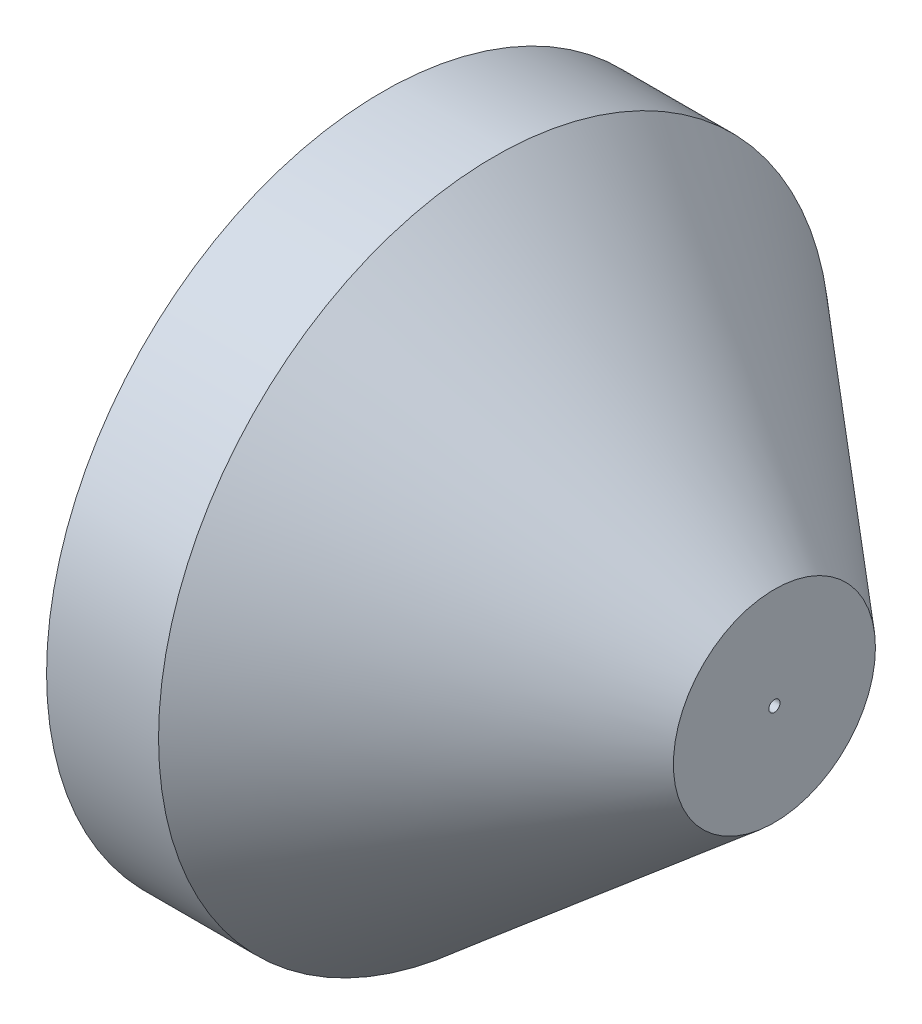
ISO-10303-21;
HEADER;
FILE_DESCRIPTION(('STEP AP214'),'2;1');
FILE_NAME('part.step','',(''),(''),'','','');
FILE_SCHEMA(('AUTOMOTIVE_DESIGN { 1 0 10303 214 1 1 1 1 }'));
ENDSEC;
DATA;
#1=APPLICATION_CONTEXT('core data for automotive mechanical design processes');
#2=APPLICATION_PROTOCOL_DEFINITION('international standard','automotive_design',2000,#1);
#3=PRODUCT_CONTEXT('',#1,'mechanical');
#4=PRODUCT('Part','Part','',(#3));
#5=PRODUCT_RELATED_PRODUCT_CATEGORY('part','',(#4));
#6=PRODUCT_DEFINITION_FORMATION('','',#4);
#7=PRODUCT_DEFINITION_CONTEXT('part definition',#1,'design');
#8=PRODUCT_DEFINITION('design','',#6,#7);
#9=PRODUCT_DEFINITION_SHAPE('','',#8);
#10=(LENGTH_UNIT() NAMED_UNIT(*) SI_UNIT(.MILLI.,.METRE.));
#11=(NAMED_UNIT(*) PLANE_ANGLE_UNIT() SI_UNIT($,.RADIAN.));
#12=(NAMED_UNIT(*) SI_UNIT($,.STERADIAN.) SOLID_ANGLE_UNIT());
#13=UNCERTAINTY_MEASURE_WITH_UNIT(LENGTH_MEASURE(1.E-05),#10,'distance_accuracy_value','');
#14=(GEOMETRIC_REPRESENTATION_CONTEXT(3) GLOBAL_UNCERTAINTY_ASSIGNED_CONTEXT((#13)) GLOBAL_UNIT_ASSIGNED_CONTEXT((#10,
#11,#12)) REPRESENTATION_CONTEXT('',''));
#15=CARTESIAN_POINT('',(0.,0.,0.));
#16=DIRECTION('',(0.,0.,1.));
#17=DIRECTION('',(1.,0.,0.));
#18=AXIS2_PLACEMENT_3D('',#15,#16,#17);
#19=CARTESIAN_POINT('',(0.,0.,0.));
#20=DIRECTION('',(1.,0.,0.));
#21=DIRECTION('',(0.,0.,-1.));
#22=AXIS2_PLACEMENT_3D('',#19,#20,#21);
#23=PLANE('',#22);
#24=CARTESIAN_POINT('',(0.,0.,0.));
#25=DIRECTION('',(1.,0.,0.));
#26=DIRECTION('',(0.,0.,-1.));
#27=AXIS2_PLACEMENT_3D('',#24,#25,#26);
#28=CIRCLE('',#27,50.);
#29=CARTESIAN_POINT('',(0.,0.,-50.));
#30=VERTEX_POINT('',#29);
#31=EDGE_CURVE('E34',#30,#30,#28,.T.);
#32=ORIENTED_EDGE('',*,*,#31,.F.);
#33=EDGE_LOOP('',(#32));
#34=FACE_BOUND('',#33,.T.);
#35=CARTESIAN_POINT('',(0.,0.,0.));
#36=DIRECTION('',(1.,0.,0.));
#37=DIRECTION('',(0.,0.,-1.));
#38=AXIS2_PLACEMENT_3D('',#35,#36,#37);
#39=CIRCLE('',#38,30.);
#40=CARTESIAN_POINT('',(0.,0.,-30.));
#41=VERTEX_POINT('',#40);
#42=EDGE_CURVE('E41',#41,#41,#39,.T.);
#43=ORIENTED_EDGE('',*,*,#42,.T.);
#44=EDGE_LOOP('',(#43));
#45=FACE_BOUND('',#44,.T.);
#46=ADVANCED_FACE('F30',(#34,#45),#23,.F.);
#47=CARTESIAN_POINT('',(20.,0.,0.));
#48=DIRECTION('',(-1.,0.,0.));
#49=DIRECTION('',(0.,0.,1.));
#50=AXIS2_PLACEMENT_3D('',#47,#48,#49);
#51=CYLINDRICAL_SURFACE('',#50,50.);
#52=CARTESIAN_POINT('',(20.,0.,0.));
#53=DIRECTION('',(1.,0.,0.));
#54=DIRECTION('',(0.,0.,-1.));
#55=AXIS2_PLACEMENT_3D('',#52,#53,#54);
#56=CIRCLE('',#55,50.);
#57=CARTESIAN_POINT('',(20.,0.,-50.));
#58=VERTEX_POINT('',#57);
#59=EDGE_CURVE('E10',#58,#58,#56,.T.);
#60=ORIENTED_EDGE('',*,*,#59,.F.);
#61=EDGE_LOOP('',(#60));
#62=FACE_BOUND('',#61,.T.);
#63=ORIENTED_EDGE('',*,*,#31,.T.);
#64=EDGE_LOOP('',(#63));
#65=FACE_BOUND('',#64,.T.);
#66=ADVANCED_FACE('F32',(#62,#65),#51,.T.);
#67=CARTESIAN_POINT('',(20.,0.,0.));
#68=DIRECTION('',(-1.,0.,0.));
#69=DIRECTION('',(0.,0.,1.));
#70=AXIS2_PLACEMENT_3D('',#67,#68,#69);
#71=CYLINDRICAL_SURFACE('',#70,30.);
#72=CARTESIAN_POINT('',(20.,0.,0.));
#73=DIRECTION('',(1.,0.,0.));
#74=DIRECTION('',(0.,0.,-1.));
#75=AXIS2_PLACEMENT_3D('',#72,#73,#74);
#76=CIRCLE('',#75,30.);
#77=CARTESIAN_POINT('',(20.,0.,-30.));
#78=VERTEX_POINT('',#77);
#79=EDGE_CURVE('E45',#78,#78,#76,.T.);
#80=ORIENTED_EDGE('',*,*,#79,.T.);
#81=EDGE_LOOP('',(#80));
#82=FACE_BOUND('',#81,.T.);
#83=ORIENTED_EDGE('',*,*,#42,.F.);
#84=EDGE_LOOP('',(#83));
#85=FACE_BOUND('',#84,.T.);
#86=ADVANCED_FACE('F84',(#82,#85),#71,.F.);
#87=CARTESIAN_POINT('',(20.,0.,0.));
#88=DIRECTION('',(1.,0.,0.));
#89=DIRECTION('',(0.,0.,-1.));
#90=AXIS2_PLACEMENT_3D('',#87,#88,#89);
#91=PLANE('',#90);
#92=CARTESIAN_POINT('',(20.,0.,0.));
#93=DIRECTION('',(-1.,0.,0.));
#94=DIRECTION('',(0.,0.,1.));
#95=AXIS2_PLACEMENT_3D('',#92,#93,#94);
#96=CIRCLE('',#95,1.);
#97=CARTESIAN_POINT('',(20.,0.,1.));
#98=VERTEX_POINT('',#97);
#99=EDGE_CURVE('E64',#98,#98,#96,.T.);
#100=ORIENTED_EDGE('',*,*,#99,.F.);
#101=EDGE_LOOP('',(#100));
#102=FACE_BOUND('',#101,.T.);
#103=ORIENTED_EDGE('',*,*,#79,.F.);
#104=EDGE_LOOP('',(#103));
#105=FACE_BOUND('',#104,.T.);
#106=ADVANCED_FACE('F80',(#102,#105),#91,.F.);
#107=CARTESIAN_POINT('',(20.,0.,0.));
#108=DIRECTION('',(-1.,0.,0.));
#109=DIRECTION('',(0.,0.,1.));
#110=AXIS2_PLACEMENT_3D('',#107,#108,#109);
#111=CIRCLE('',#110,55.);
#112=CARTESIAN_POINT('',(20.,0.,55.));
#113=VERTEX_POINT('',#112);
#114=EDGE_CURVE('E58',#113,#113,#111,.T.);
#115=ORIENTED_EDGE('',*,*,#114,.T.);
#116=EDGE_LOOP('',(#115));
#117=FACE_BOUND('',#116,.T.);
#118=ORIENTED_EDGE('',*,*,#59,.T.);
#119=EDGE_LOOP('',(#118));
#120=FACE_BOUND('',#119,.T.);
#121=ADVANCED_FACE('F83',(#117,#120),#91,.F.);
#122=CARTESIAN_POINT('',(0.,0.,0.));
#123=DIRECTION('',(-1.,0.,0.));
#124=DIRECTION('',(0.,0.,1.));
#125=AXIS2_PLACEMENT_3D('',#122,#123,#124);
#126=PLANE('',#125);
#127=CARTESIAN_POINT('',(0.,0.,0.));
#128=DIRECTION('',(-1.,0.,0.));
#129=DIRECTION('',(0.,0.,1.));
#130=AXIS2_PLACEMENT_3D('',#127,#128,#129);
#131=CIRCLE('',#130,60.);
#132=CARTESIAN_POINT('',(0.,0.,60.));
#133=VERTEX_POINT('',#132);
#134=EDGE_CURVE('E51',#133,#133,#131,.T.);
#135=ORIENTED_EDGE('',*,*,#134,.T.);
#136=EDGE_LOOP('',(#135));
#137=FACE_BOUND('',#136,.T.);
#138=CARTESIAN_POINT('',(0.,0.,0.));
#139=DIRECTION('',(-1.,0.,0.));
#140=DIRECTION('',(0.,0.,1.));
#141=AXIS2_PLACEMENT_3D('',#138,#139,#140);
#142=CIRCLE('',#141,55.);
#143=CARTESIAN_POINT('',(0.,0.,55.));
#144=VERTEX_POINT('',#143);
#145=EDGE_CURVE('E55',#144,#144,#142,.T.);
#146=ORIENTED_EDGE('',*,*,#145,.F.);
#147=EDGE_LOOP('',(#146));
#148=FACE_BOUND('',#147,.T.);
#149=ADVANCED_FACE('F110',(#137,#148),#126,.T.);
#150=CARTESIAN_POINT('',(0.,0.,0.));
#151=DIRECTION('',(1.,0.,0.));
#152=DIRECTION('',(0.,0.,-1.));
#153=AXIS2_PLACEMENT_3D('',#150,#151,#152);
#154=CYLINDRICAL_SURFACE('',#153,60.);
#155=ORIENTED_EDGE('',*,*,#134,.F.);
#156=EDGE_LOOP('',(#155));
#157=FACE_BOUND('',#156,.T.);
#158=CARTESIAN_POINT('',(20.,0.,0.));
#159=DIRECTION('',(-1.,0.,0.));
#160=DIRECTION('',(0.,0.,1.));
#161=AXIS2_PLACEMENT_3D('',#158,#159,#160);
#162=CIRCLE('',#161,60.);
#163=CARTESIAN_POINT('',(20.,0.,60.));
#164=VERTEX_POINT('',#163);
#165=EDGE_CURVE('E52',#164,#164,#162,.T.);
#166=ORIENTED_EDGE('',*,*,#165,.T.);
#167=EDGE_LOOP('',(#166));
#168=FACE_BOUND('',#167,.T.);
#169=ADVANCED_FACE('F107',(#157,#168),#154,.T.);
#170=CARTESIAN_POINT('',(0.,0.,0.));
#171=DIRECTION('',(1.,0.,0.));
#172=DIRECTION('',(0.,0.,-1.));
#173=AXIS2_PLACEMENT_3D('',#170,#171,#172);
#174=CYLINDRICAL_SURFACE('',#173,55.);
#175=ORIENTED_EDGE('',*,*,#145,.T.);
#176=EDGE_LOOP('',(#175));
#177=FACE_BOUND('',#176,.T.);
#178=ORIENTED_EDGE('',*,*,#114,.F.);
#179=EDGE_LOOP('',(#178));
#180=FACE_BOUND('',#179,.T.);
#181=ADVANCED_FACE('F106',(#177,#180),#174,.F.);
#182=CARTESIAN_POINT('',(70.,0.,0.));
#183=DIRECTION('',(1.,0.,0.));
#184=DIRECTION('',(0.,0.,-1.));
#185=AXIS2_PLACEMENT_3D('',#182,#183,#184);
#186=PLANE('',#185);
#187=CARTESIAN_POINT('',(70.,0.,0.));
#188=DIRECTION('',(-1.,0.,0.));
#189=DIRECTION('',(0.,0.,1.));
#190=AXIS2_PLACEMENT_3D('',#187,#188,#189);
#191=CIRCLE('',#190,1.);
#192=CARTESIAN_POINT('',(70.,0.,1.));
#193=VERTEX_POINT('',#192);
#194=EDGE_CURVE('E61',#193,#193,#191,.T.);
#195=ORIENTED_EDGE('',*,*,#194,.T.);
#196=EDGE_LOOP('',(#195));
#197=FACE_BOUND('',#196,.T.);
#198=CARTESIAN_POINT('',(70.,0.,0.));
#199=DIRECTION('',(1.,0.,0.));
#200=DIRECTION('',(0.,0.,-1.));
#201=AXIS2_PLACEMENT_3D('',#198,#199,#200);
#202=CIRCLE('',#201,18.0450184411359);
#203=CARTESIAN_POINT('',(70.,0.,-18.0450184411359));
#204=VERTEX_POINT('',#203);
#205=EDGE_CURVE('E48',#204,#204,#202,.T.);
#206=ORIENTED_EDGE('',*,*,#205,.T.);
#207=EDGE_LOOP('',(#206));
#208=FACE_BOUND('',#207,.T.);
#209=ADVANCED_FACE('F70',(#197,#208),#186,.T.);
#210=CARTESIAN_POINT('',(20.,0.,0.));
#211=DIRECTION('',(-1.,0.,0.));
#212=DIRECTION('',(0.,0.,-1.));
#213=AXIS2_PLACEMENT_3D('',#210,#211,#212);
#214=CONICAL_SURFACE('',#213,60.,0.698131700797733);
#215=ORIENTED_EDGE('',*,*,#205,.F.);
#216=EDGE_LOOP('',(#215));
#217=FACE_BOUND('',#216,.T.);
#218=ORIENTED_EDGE('',*,*,#165,.F.);
#219=EDGE_LOOP('',(#218));
#220=FACE_BOUND('',#219,.T.);
#221=ADVANCED_FACE('F76',(#217,#220),#214,.T.);
#222=CARTESIAN_POINT('',(70.,0.,0.));
#223=DIRECTION('',(-1.,0.,0.));
#224=DIRECTION('',(0.,0.,1.));
#225=AXIS2_PLACEMENT_3D('',#222,#223,#224);
#226=CYLINDRICAL_SURFACE('',#225,1.);
#227=ORIENTED_EDGE('',*,*,#194,.F.);
#228=EDGE_LOOP('',(#227));
#229=FACE_BOUND('',#228,.T.);
#230=ORIENTED_EDGE('',*,*,#99,.T.);
#231=EDGE_LOOP('',(#230));
#232=FACE_BOUND('',#231,.T.);
#233=ADVANCED_FACE('F73',(#229,#232),#226,.F.);
#234=CLOSED_SHELL('',(#46,#66,#86,#106,#121,#149,#169,#181,#209,#221,#233));
#235=MANIFOLD_SOLID_BREP('B2',#234);
#236=ADVANCED_BREP_SHAPE_REPRESENTATION('',(#18,#235),#14);
#237=SHAPE_DEFINITION_REPRESENTATION(#9,#236);
ENDSEC;
END-ISO-10303-21;
